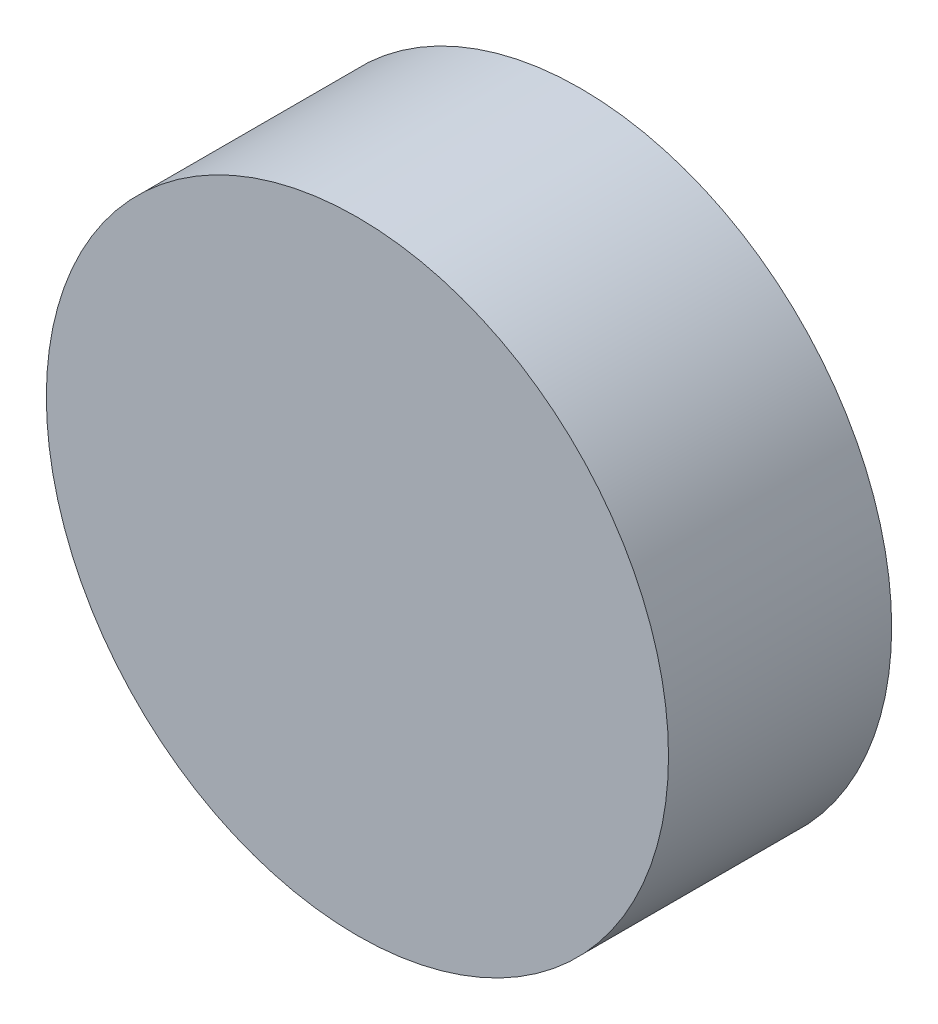
ISO-10303-21;
HEADER;
FILE_DESCRIPTION(('STEP AP214'),'2;1');
FILE_NAME('part.step','',(''),(''),'','','');
FILE_SCHEMA(('AUTOMOTIVE_DESIGN { 1 0 10303 214 1 1 1 1 }'));
ENDSEC;
DATA;
#1=APPLICATION_CONTEXT('core data for automotive mechanical design processes');
#2=APPLICATION_PROTOCOL_DEFINITION('international standard','automotive_design',2000,#1);
#3=PRODUCT_CONTEXT('',#1,'mechanical');
#4=PRODUCT('Part','Part','',(#3));
#5=PRODUCT_RELATED_PRODUCT_CATEGORY('part','',(#4));
#6=PRODUCT_DEFINITION_FORMATION('','',#4);
#7=PRODUCT_DEFINITION_CONTEXT('part definition',#1,'design');
#8=PRODUCT_DEFINITION('design','',#6,#7);
#9=PRODUCT_DEFINITION_SHAPE('','',#8);
#10=(LENGTH_UNIT() NAMED_UNIT(*) SI_UNIT(.MILLI.,.METRE.));
#11=(NAMED_UNIT(*) PLANE_ANGLE_UNIT() SI_UNIT($,.RADIAN.));
#12=(NAMED_UNIT(*) SI_UNIT($,.STERADIAN.) SOLID_ANGLE_UNIT());
#13=UNCERTAINTY_MEASURE_WITH_UNIT(LENGTH_MEASURE(1.E-05),#10,'distance_accuracy_value','');
#14=(GEOMETRIC_REPRESENTATION_CONTEXT(3) GLOBAL_UNCERTAINTY_ASSIGNED_CONTEXT((#13)) GLOBAL_UNIT_ASSIGNED_CONTEXT((#10,
#11,#12)) REPRESENTATION_CONTEXT('',''));
#15=CARTESIAN_POINT('',(0.,0.,0.));
#16=DIRECTION('',(0.,0.,1.));
#17=DIRECTION('',(1.,0.,0.));
#18=AXIS2_PLACEMENT_3D('',#15,#16,#17);
#19=CARTESIAN_POINT('',(0.,0.,53.8));
#20=DIRECTION('',(0.,0.,-1.));
#21=DIRECTION('',(-1.,0.,0.));
#22=AXIS2_PLACEMENT_3D('',#19,#20,#21);
#23=CYLINDRICAL_SURFACE('',#22,75.);
#24=CARTESIAN_POINT('',(0.,0.,53.8));
#25=DIRECTION('',(0.,0.,1.));
#26=DIRECTION('',(1.,0.,0.));
#27=AXIS2_PLACEMENT_3D('',#24,#25,#26);
#28=CIRCLE('',#27,75.);
#29=CARTESIAN_POINT('',(75.,0.,53.8));
#30=VERTEX_POINT('',#29);
#31=EDGE_CURVE('E10',#30,#30,#28,.T.);
#32=ORIENTED_EDGE('',*,*,#31,.F.);
#33=EDGE_LOOP('',(#32));
#34=FACE_BOUND('',#33,.T.);
#35=CARTESIAN_POINT('',(0.,0.,0.));
#36=DIRECTION('',(0.,0.,1.));
#37=DIRECTION('',(1.,0.,0.));
#38=AXIS2_PLACEMENT_3D('',#35,#36,#37);
#39=CIRCLE('',#38,75.);
#40=CARTESIAN_POINT('',(75.,0.,0.));
#41=VERTEX_POINT('',#40);
#42=EDGE_CURVE('E36',#41,#41,#39,.T.);
#43=ORIENTED_EDGE('',*,*,#42,.T.);
#44=EDGE_LOOP('',(#43));
#45=FACE_BOUND('',#44,.T.);
#46=ADVANCED_FACE('F33',(#34,#45),#23,.T.);
#47=CARTESIAN_POINT('',(0.,0.,53.8));
#48=DIRECTION('',(0.,0.,1.));
#49=DIRECTION('',(1.,0.,0.));
#50=AXIS2_PLACEMENT_3D('',#47,#48,#49);
#51=PLANE('',#50);
#52=ORIENTED_EDGE('',*,*,#31,.T.);
#53=EDGE_LOOP('',(#52));
#54=FACE_BOUND('',#53,.T.);
#55=ADVANCED_FACE('F48',(#54),#51,.T.);
#56=CARTESIAN_POINT('',(0.,0.,0.));
#57=DIRECTION('',(0.,0.,1.));
#58=DIRECTION('',(1.,0.,0.));
#59=AXIS2_PLACEMENT_3D('',#56,#57,#58);
#60=PLANE('',#59);
#61=ORIENTED_EDGE('',*,*,#42,.F.);
#62=EDGE_LOOP('',(#61));
#63=FACE_BOUND('',#62,.T.);
#64=ADVANCED_FACE('F46',(#63),#60,.F.);
#65=CLOSED_SHELL('',(#46,#55,#64));
#66=MANIFOLD_SOLID_BREP('B2',#65);
#67=ADVANCED_BREP_SHAPE_REPRESENTATION('',(#18,#66),#14);
#68=SHAPE_DEFINITION_REPRESENTATION(#9,#67);
ENDSEC;
END-ISO-10303-21;
